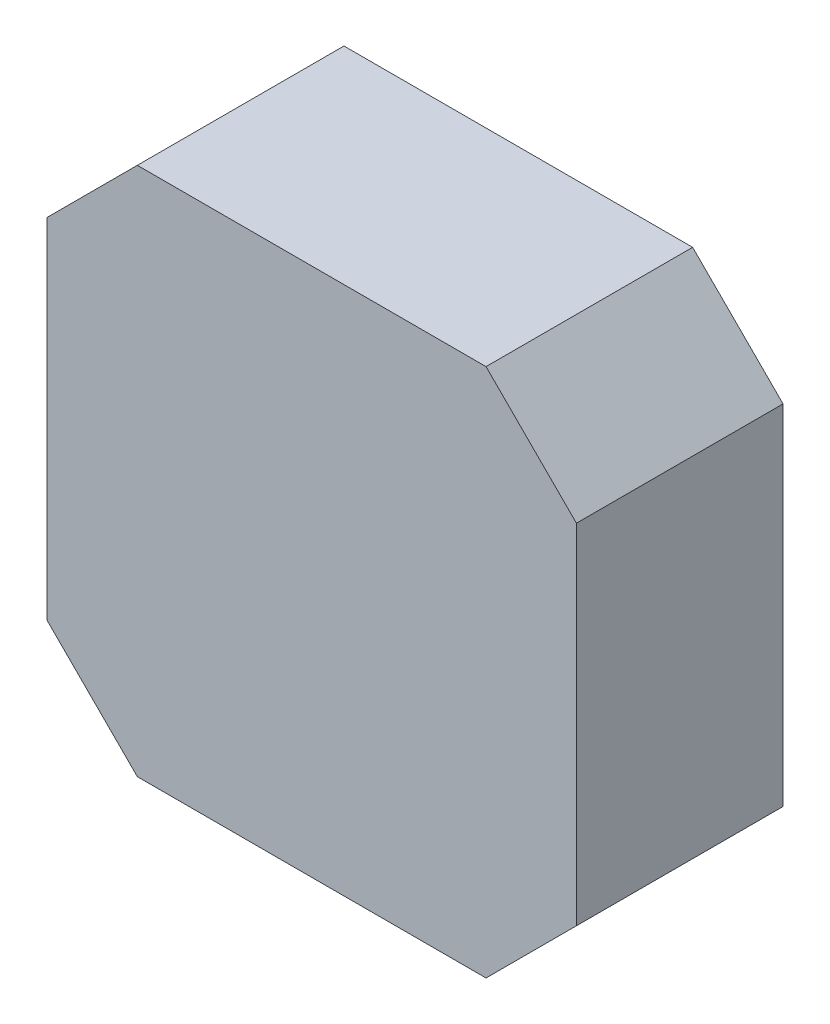
ISO-10303-21;
HEADER;
FILE_DESCRIPTION(('STEP AP214'),'2;1');
FILE_NAME('part.step','',(''),(''),'','','');
FILE_SCHEMA(('AUTOMOTIVE_DESIGN { 1 0 10303 214 1 1 1 1 }'));
ENDSEC;
DATA;
#1=APPLICATION_CONTEXT('core data for automotive mechanical design processes');
#2=APPLICATION_PROTOCOL_DEFINITION('international standard','automotive_design',2000,#1);
#3=PRODUCT_CONTEXT('',#1,'mechanical');
#4=PRODUCT('Part','Part','',(#3));
#5=PRODUCT_RELATED_PRODUCT_CATEGORY('part','',(#4));
#6=PRODUCT_DEFINITION_FORMATION('','',#4);
#7=PRODUCT_DEFINITION_CONTEXT('part definition',#1,'design');
#8=PRODUCT_DEFINITION('design','',#6,#7);
#9=PRODUCT_DEFINITION_SHAPE('','',#8);
#10=(LENGTH_UNIT() NAMED_UNIT(*) SI_UNIT(.MILLI.,.METRE.));
#11=(NAMED_UNIT(*) PLANE_ANGLE_UNIT() SI_UNIT($,.RADIAN.));
#12=(NAMED_UNIT(*) SI_UNIT($,.STERADIAN.) SOLID_ANGLE_UNIT());
#13=UNCERTAINTY_MEASURE_WITH_UNIT(LENGTH_MEASURE(1.E-05),#10,'distance_accuracy_value','');
#14=(GEOMETRIC_REPRESENTATION_CONTEXT(3) GLOBAL_UNCERTAINTY_ASSIGNED_CONTEXT((#13)) GLOBAL_UNIT_ASSIGNED_CONTEXT((#10,
#11,#12)) REPRESENTATION_CONTEXT('',''));
#15=CARTESIAN_POINT('',(0.,0.,0.));
#16=DIRECTION('',(0.,0.,1.));
#17=DIRECTION('',(1.,0.,0.));
#18=AXIS2_PLACEMENT_3D('',#15,#16,#17);
#19=CARTESIAN_POINT('',(-20.5,13.5,16.));
#20=DIRECTION('',(1.,0.,0.));
#21=DIRECTION('',(0.,1.,0.));
#22=AXIS2_PLACEMENT_3D('',#19,#20,#21);
#23=PLANE('',#22);
#24=DIRECTION('',(0.,-1.,0.));
#25=VECTOR('',#24,1.);
#26=CARTESIAN_POINT('',(-20.5,13.5,0.));
#27=LINE('',#26,#25);
#28=CARTESIAN_POINT('',(-20.5,13.5,0.));
#29=VERTEX_POINT('',#28);
#30=CARTESIAN_POINT('',(-20.5,-13.5,0.));
#31=VERTEX_POINT('',#30);
#32=EDGE_CURVE('E129',#29,#31,#27,.T.);
#33=ORIENTED_EDGE('',*,*,#32,.T.);
#34=DIRECTION('',(0.,0.,-1.));
#35=VECTOR('',#34,1.);
#36=CARTESIAN_POINT('',(-20.5,-13.5,16.));
#37=LINE('',#36,#35);
#38=CARTESIAN_POINT('',(-20.5,-13.5,16.));
#39=VERTEX_POINT('',#38);
#40=EDGE_CURVE('E11',#39,#31,#37,.T.);
#41=ORIENTED_EDGE('',*,*,#40,.F.);
#42=DIRECTION('',(0.,-1.,0.));
#43=VECTOR('',#42,1.);
#44=CARTESIAN_POINT('',(-20.5,13.5,16.));
#45=LINE('',#44,#43);
#46=CARTESIAN_POINT('',(-20.5,13.5,16.));
#47=VERTEX_POINT('',#46);
#48=EDGE_CURVE('E143',#47,#39,#45,.T.);
#49=ORIENTED_EDGE('',*,*,#48,.F.);
#50=DIRECTION('',(0.,0.,-1.));
#51=VECTOR('',#50,1.);
#52=CARTESIAN_POINT('',(-20.5,13.5,16.));
#53=LINE('',#52,#51);
#54=EDGE_CURVE('E125',#47,#29,#53,.T.);
#55=ORIENTED_EDGE('',*,*,#54,.T.);
#56=EDGE_LOOP('',(#33,#41,#49,#55));
#57=FACE_BOUND('',#56,.T.);
#58=ADVANCED_FACE('F33',(#57),#23,.F.);
#59=CARTESIAN_POINT('',(-20.5,-13.5,16.));
#60=DIRECTION('',(0.707106781186548,0.707106781186547,0.));
#61=DIRECTION('',(-0.707106781186547,0.707106781186548,0.));
#62=AXIS2_PLACEMENT_3D('',#59,#60,#61);
#63=PLANE('',#62);
#64=DIRECTION('',(0.707106781186547,-0.707106781186548,0.));
#65=VECTOR('',#64,1.);
#66=CARTESIAN_POINT('',(-20.5,-13.5,0.));
#67=LINE('',#66,#65);
#68=CARTESIAN_POINT('',(-13.5,-20.5,0.));
#69=VERTEX_POINT('',#68);
#70=EDGE_CURVE('E132',#31,#69,#67,.T.);
#71=ORIENTED_EDGE('',*,*,#70,.T.);
#72=DIRECTION('',(0.,0.,-1.));
#73=VECTOR('',#72,1.);
#74=CARTESIAN_POINT('',(-13.5,-20.5,16.));
#75=LINE('',#74,#73);
#76=CARTESIAN_POINT('',(-13.5,-20.5,16.));
#77=VERTEX_POINT('',#76);
#78=EDGE_CURVE('E41',#77,#69,#75,.T.);
#79=ORIENTED_EDGE('',*,*,#78,.F.);
#80=DIRECTION('',(0.707106781186547,-0.707106781186548,0.));
#81=VECTOR('',#80,1.);
#82=CARTESIAN_POINT('',(-20.5,-13.5,16.));
#83=LINE('',#82,#81);
#84=EDGE_CURVE('E92',#39,#77,#83,.T.);
#85=ORIENTED_EDGE('',*,*,#84,.F.);
#86=ORIENTED_EDGE('',*,*,#40,.T.);
#87=EDGE_LOOP('',(#71,#79,#85,#86));
#88=FACE_BOUND('',#87,.T.);
#89=ADVANCED_FACE('F178',(#88),#63,.F.);
#90=CARTESIAN_POINT('',(-13.5,-20.5,16.));
#91=DIRECTION('',(0.,1.,0.));
#92=DIRECTION('',(-1.,0.,0.));
#93=AXIS2_PLACEMENT_3D('',#90,#91,#92);
#94=PLANE('',#93);
#95=DIRECTION('',(1.,0.,0.));
#96=VECTOR('',#95,1.);
#97=CARTESIAN_POINT('',(-13.5,-20.5,0.));
#98=LINE('',#97,#96);
#99=CARTESIAN_POINT('',(13.5,-20.5,0.));
#100=VERTEX_POINT('',#99);
#101=EDGE_CURVE('E134',#69,#100,#98,.T.);
#102=ORIENTED_EDGE('',*,*,#101,.T.);
#103=DIRECTION('',(0.,0.,-1.));
#104=VECTOR('',#103,1.);
#105=CARTESIAN_POINT('',(13.5,-20.5,16.));
#106=LINE('',#105,#104);
#107=CARTESIAN_POINT('',(13.5,-20.5,16.));
#108=VERTEX_POINT('',#107);
#109=EDGE_CURVE('E150',#108,#100,#106,.T.);
#110=ORIENTED_EDGE('',*,*,#109,.F.);
#111=DIRECTION('',(1.,0.,0.));
#112=VECTOR('',#111,1.);
#113=CARTESIAN_POINT('',(-13.5,-20.5,16.));
#114=LINE('',#113,#112);
#115=EDGE_CURVE('E158',#77,#108,#114,.T.);
#116=ORIENTED_EDGE('',*,*,#115,.F.);
#117=ORIENTED_EDGE('',*,*,#78,.T.);
#118=EDGE_LOOP('',(#102,#110,#116,#117));
#119=FACE_BOUND('',#118,.T.);
#120=ADVANCED_FACE('F156',(#119),#94,.F.);
#121=CARTESIAN_POINT('',(20.5,-13.5,16.));
#122=DIRECTION('',(-0.707106781186548,0.707106781186547,0.));
#123=DIRECTION('',(-0.707106781186547,-0.707106781186548,0.));
#124=AXIS2_PLACEMENT_3D('',#121,#122,#123);
#125=PLANE('',#124);
#126=DIRECTION('',(0.707106781186547,0.707106781186548,0.));
#127=VECTOR('',#126,1.);
#128=CARTESIAN_POINT('',(20.5,-13.5,0.));
#129=LINE('',#128,#127);
#130=CARTESIAN_POINT('',(20.5,-13.5,0.));
#131=VERTEX_POINT('',#130);
#132=EDGE_CURVE('E136',#100,#131,#129,.T.);
#133=ORIENTED_EDGE('',*,*,#132,.T.);
#134=DIRECTION('',(0.,0.,-1.));
#135=VECTOR('',#134,1.);
#136=CARTESIAN_POINT('',(20.5,-13.5,16.));
#137=LINE('',#136,#135);
#138=CARTESIAN_POINT('',(20.5,-13.5,16.));
#139=VERTEX_POINT('',#138);
#140=EDGE_CURVE('E147',#139,#131,#137,.T.);
#141=ORIENTED_EDGE('',*,*,#140,.F.);
#142=DIRECTION('',(0.707106781186547,0.707106781186548,0.));
#143=VECTOR('',#142,1.);
#144=CARTESIAN_POINT('',(20.5,-13.5,16.));
#145=LINE('',#144,#143);
#146=EDGE_CURVE('E170',#108,#139,#145,.T.);
#147=ORIENTED_EDGE('',*,*,#146,.F.);
#148=ORIENTED_EDGE('',*,*,#109,.T.);
#149=EDGE_LOOP('',(#133,#141,#147,#148));
#150=FACE_BOUND('',#149,.T.);
#151=ADVANCED_FACE('F166',(#150),#125,.F.);
#152=CARTESIAN_POINT('',(20.5,13.5,16.));
#153=DIRECTION('',(-1.,0.,0.));
#154=DIRECTION('',(0.,-1.,0.));
#155=AXIS2_PLACEMENT_3D('',#152,#153,#154);
#156=PLANE('',#155);
#157=DIRECTION('',(0.,1.,0.));
#158=VECTOR('',#157,1.);
#159=CARTESIAN_POINT('',(20.5,13.5,0.));
#160=LINE('',#159,#158);
#161=CARTESIAN_POINT('',(20.5,13.5,0.));
#162=VERTEX_POINT('',#161);
#163=EDGE_CURVE('E138',#131,#162,#160,.T.);
#164=ORIENTED_EDGE('',*,*,#163,.T.);
#165=DIRECTION('',(0.,0.,-1.));
#166=VECTOR('',#165,1.);
#167=CARTESIAN_POINT('',(20.5,13.5,16.));
#168=LINE('',#167,#166);
#169=CARTESIAN_POINT('',(20.5,13.5,16.));
#170=VERTEX_POINT('',#169);
#171=EDGE_CURVE('E120',#170,#162,#168,.T.);
#172=ORIENTED_EDGE('',*,*,#171,.F.);
#173=DIRECTION('',(0.,1.,0.));
#174=VECTOR('',#173,1.);
#175=CARTESIAN_POINT('',(20.5,13.5,16.));
#176=LINE('',#175,#174);
#177=EDGE_CURVE('E111',#139,#170,#176,.T.);
#178=ORIENTED_EDGE('',*,*,#177,.F.);
#179=ORIENTED_EDGE('',*,*,#140,.T.);
#180=EDGE_LOOP('',(#164,#172,#178,#179));
#181=FACE_BOUND('',#180,.T.);
#182=ADVANCED_FACE('F169',(#181),#156,.F.);
#183=CARTESIAN_POINT('',(13.5,20.5,16.));
#184=DIRECTION('',(-0.707106781186547,-0.707106781186548,0.));
#185=DIRECTION('',(0.707106781186548,-0.707106781186547,0.));
#186=AXIS2_PLACEMENT_3D('',#183,#184,#185);
#187=PLANE('',#186);
#188=DIRECTION('',(-0.707106781186548,0.707106781186547,0.));
#189=VECTOR('',#188,1.);
#190=CARTESIAN_POINT('',(13.5,20.5,0.));
#191=LINE('',#190,#189);
#192=CARTESIAN_POINT('',(13.5,20.5,0.));
#193=VERTEX_POINT('',#192);
#194=EDGE_CURVE('E119',#162,#193,#191,.T.);
#195=ORIENTED_EDGE('',*,*,#194,.T.);
#196=DIRECTION('',(0.,0.,-1.));
#197=VECTOR('',#196,1.);
#198=CARTESIAN_POINT('',(13.5,20.5,16.));
#199=LINE('',#198,#197);
#200=CARTESIAN_POINT('',(13.5,20.5,16.));
#201=VERTEX_POINT('',#200);
#202=EDGE_CURVE('E116',#201,#193,#199,.T.);
#203=ORIENTED_EDGE('',*,*,#202,.F.);
#204=DIRECTION('',(-0.707106781186548,0.707106781186547,0.));
#205=VECTOR('',#204,1.);
#206=CARTESIAN_POINT('',(13.5,20.5,16.));
#207=LINE('',#206,#205);
#208=EDGE_CURVE('E105',#170,#201,#207,.T.);
#209=ORIENTED_EDGE('',*,*,#208,.F.);
#210=ORIENTED_EDGE('',*,*,#171,.T.);
#211=EDGE_LOOP('',(#195,#203,#209,#210));
#212=FACE_BOUND('',#211,.T.);
#213=ADVANCED_FACE('F117',(#212),#187,.F.);
#214=CARTESIAN_POINT('',(-13.5,20.5,16.));
#215=DIRECTION('',(0.,-1.,0.));
#216=DIRECTION('',(0.,0.,-1.));
#217=AXIS2_PLACEMENT_3D('',#214,#215,#216);
#218=PLANE('',#217);
#219=DIRECTION('',(-1.,0.,0.));
#220=VECTOR('',#219,1.);
#221=CARTESIAN_POINT('',(-13.5,20.5,0.));
#222=LINE('',#221,#220);
#223=CARTESIAN_POINT('',(-13.5,20.5,0.));
#224=VERTEX_POINT('',#223);
#225=EDGE_CURVE('E78',#193,#224,#222,.T.);
#226=ORIENTED_EDGE('',*,*,#225,.T.);
#227=DIRECTION('',(0.,0.,-1.));
#228=VECTOR('',#227,1.);
#229=CARTESIAN_POINT('',(-13.5,20.5,16.));
#230=LINE('',#229,#228);
#231=CARTESIAN_POINT('',(-13.5,20.5,16.));
#232=VERTEX_POINT('',#231);
#233=EDGE_CURVE('E121',#232,#224,#230,.T.);
#234=ORIENTED_EDGE('',*,*,#233,.F.);
#235=DIRECTION('',(-1.,0.,0.));
#236=VECTOR('',#235,1.);
#237=CARTESIAN_POINT('',(-13.5,20.5,16.));
#238=LINE('',#237,#236);
#239=EDGE_CURVE('E109',#201,#232,#238,.T.);
#240=ORIENTED_EDGE('',*,*,#239,.F.);
#241=ORIENTED_EDGE('',*,*,#202,.T.);
#242=EDGE_LOOP('',(#226,#234,#240,#241));
#243=FACE_BOUND('',#242,.T.);
#244=ADVANCED_FACE('F123',(#243),#218,.F.);
#245=CARTESIAN_POINT('',(-13.5,20.5,16.));
#246=DIRECTION('',(0.707106781186547,-0.707106781186547,0.));
#247=DIRECTION('',(0.707106781186548,0.707106781186548,0.));
#248=AXIS2_PLACEMENT_3D('',#245,#246,#247);
#249=PLANE('',#248);
#250=DIRECTION('',(-0.707106781186547,-0.707106781186547,0.));
#251=VECTOR('',#250,1.);
#252=CARTESIAN_POINT('',(-13.5,20.5,0.));
#253=LINE('',#252,#251);
#254=EDGE_CURVE('E84',#224,#29,#253,.T.);
#255=ORIENTED_EDGE('',*,*,#254,.T.);
#256=ORIENTED_EDGE('',*,*,#54,.F.);
#257=DIRECTION('',(-0.707106781186547,-0.707106781186547,0.));
#258=VECTOR('',#257,1.);
#259=CARTESIAN_POINT('',(-13.5,20.5,16.));
#260=LINE('',#259,#258);
#261=EDGE_CURVE('E49',#232,#47,#260,.T.);
#262=ORIENTED_EDGE('',*,*,#261,.F.);
#263=ORIENTED_EDGE('',*,*,#233,.T.);
#264=EDGE_LOOP('',(#255,#256,#262,#263));
#265=FACE_BOUND('',#264,.T.);
#266=ADVANCED_FACE('F194',(#265),#249,.F.);
#267=CARTESIAN_POINT('',(0.,0.,16.));
#268=DIRECTION('',(0.,0.,1.));
#269=DIRECTION('',(1.,0.,0.));
#270=AXIS2_PLACEMENT_3D('',#267,#268,#269);
#271=PLANE('',#270);
#272=ORIENTED_EDGE('',*,*,#48,.T.);
#273=ORIENTED_EDGE('',*,*,#84,.T.);
#274=ORIENTED_EDGE('',*,*,#115,.T.);
#275=ORIENTED_EDGE('',*,*,#146,.T.);
#276=ORIENTED_EDGE('',*,*,#177,.T.);
#277=ORIENTED_EDGE('',*,*,#208,.T.);
#278=ORIENTED_EDGE('',*,*,#239,.T.);
#279=ORIENTED_EDGE('',*,*,#261,.T.);
#280=EDGE_LOOP('',(#272,#273,#274,#275,#276,#277,#278,#279));
#281=FACE_BOUND('',#280,.T.);
#282=ADVANCED_FACE('F107',(#281),#271,.T.);
#283=CARTESIAN_POINT('',(0.,0.,0.));
#284=DIRECTION('',(0.,0.,1.));
#285=DIRECTION('',(1.,0.,0.));
#286=AXIS2_PLACEMENT_3D('',#283,#284,#285);
#287=PLANE('',#286);
#288=ORIENTED_EDGE('',*,*,#32,.F.);
#289=ORIENTED_EDGE('',*,*,#254,.F.);
#290=ORIENTED_EDGE('',*,*,#225,.F.);
#291=ORIENTED_EDGE('',*,*,#194,.F.);
#292=ORIENTED_EDGE('',*,*,#163,.F.);
#293=ORIENTED_EDGE('',*,*,#132,.F.);
#294=ORIENTED_EDGE('',*,*,#101,.F.);
#295=ORIENTED_EDGE('',*,*,#70,.F.);
#296=EDGE_LOOP('',(#288,#289,#290,#291,#292,#293,#294,#295));
#297=FACE_BOUND('',#296,.T.);
#298=ADVANCED_FACE('F162',(#297),#287,.F.);
#299=CLOSED_SHELL('',(#58,#89,#120,#151,#182,#213,#244,#266,#282,#298));
#300=MANIFOLD_SOLID_BREP('B2',#299);
#301=ADVANCED_BREP_SHAPE_REPRESENTATION('',(#18,#300),#14);
#302=SHAPE_DEFINITION_REPRESENTATION(#9,#301);
ENDSEC;
END-ISO-10303-21;
